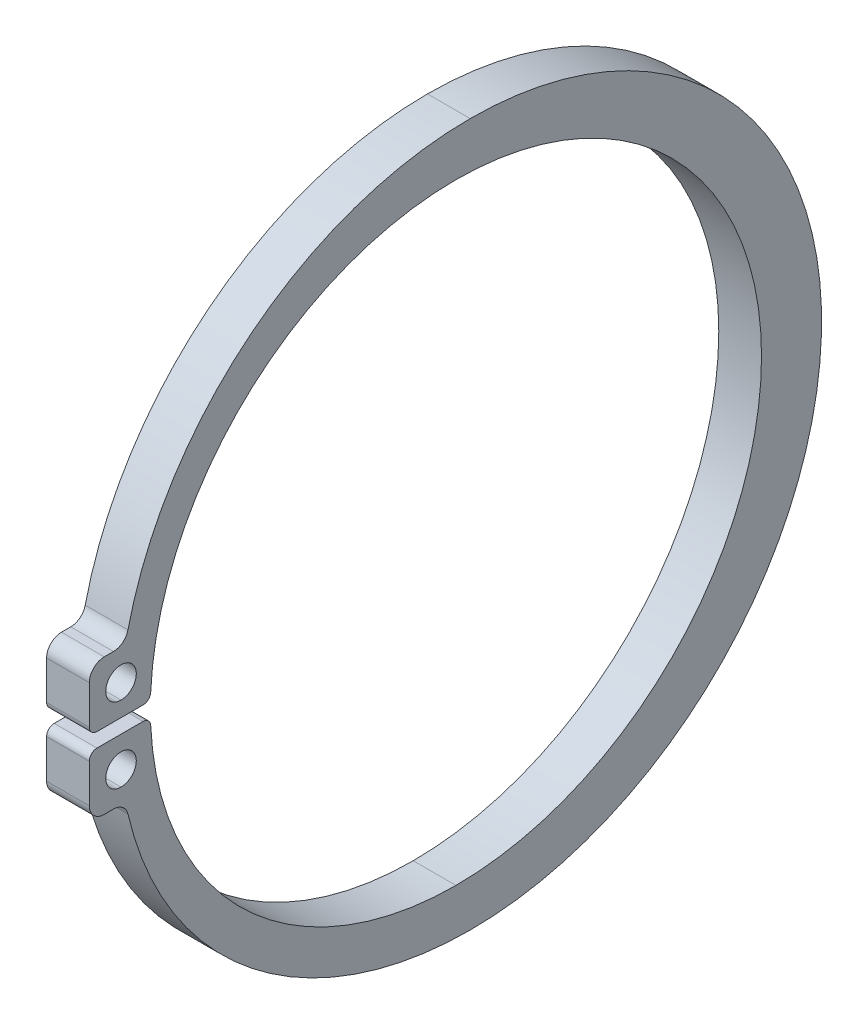
ISO-10303-21;
HEADER;
FILE_DESCRIPTION(('STEP AP214'),'2;1');
FILE_NAME('part.step','',(''),(''),'','','');
FILE_SCHEMA(('AUTOMOTIVE_DESIGN { 1 0 10303 214 1 1 1 1 }'));
ENDSEC;
DATA;
#1=APPLICATION_CONTEXT('core data for automotive mechanical design processes');
#2=APPLICATION_PROTOCOL_DEFINITION('international standard','automotive_design',2000,#1);
#3=PRODUCT_CONTEXT('',#1,'mechanical');
#4=PRODUCT('Part','Part','',(#3));
#5=PRODUCT_RELATED_PRODUCT_CATEGORY('part','',(#4));
#6=PRODUCT_DEFINITION_FORMATION('','',#4);
#7=PRODUCT_DEFINITION_CONTEXT('part definition',#1,'design');
#8=PRODUCT_DEFINITION('design','',#6,#7);
#9=PRODUCT_DEFINITION_SHAPE('','',#8);
#10=(LENGTH_UNIT() NAMED_UNIT(*) SI_UNIT(.MILLI.,.METRE.));
#11=(NAMED_UNIT(*) PLANE_ANGLE_UNIT() SI_UNIT($,.RADIAN.));
#12=(NAMED_UNIT(*) SI_UNIT($,.STERADIAN.) SOLID_ANGLE_UNIT());
#13=UNCERTAINTY_MEASURE_WITH_UNIT(LENGTH_MEASURE(1.E-05),#10,'distance_accuracy_value','');
#14=(GEOMETRIC_REPRESENTATION_CONTEXT(3) GLOBAL_UNCERTAINTY_ASSIGNED_CONTEXT((#13)) GLOBAL_UNIT_ASSIGNED_CONTEXT((#10,
#11,#12)) REPRESENTATION_CONTEXT('',''));
#15=CARTESIAN_POINT('',(0.,0.,0.));
#16=DIRECTION('',(0.,0.,1.));
#17=DIRECTION('',(1.,0.,0.));
#18=AXIS2_PLACEMENT_3D('',#15,#16,#17);
#19=CARTESIAN_POINT('',(-34.,7.87708333333333,-1.25745180226376));
#20=DIRECTION('',(1.,0.,0.));
#21=DIRECTION('',(0.,-1.,0.));
#22=AXIS2_PLACEMENT_3D('',#19,#20,#21);
#23=CYLINDRICAL_SURFACE('',#22,0.17875);
#24=CARTESIAN_POINT('',(-34.,7.87708333333333,-1.25745180226376));
#25=DIRECTION('',(-1.,0.,0.));
#26=DIRECTION('',(0.,-1.,0.));
#27=AXIS2_PLACEMENT_3D('',#24,#25,#26);
#28=CIRCLE('',#27,0.17875);
#29=CARTESIAN_POINT('',(-34.,8.05583333333333,-1.25745180226376));
#30=VERTEX_POINT('',#29);
#31=CARTESIAN_POINT('',(-34.,7.8855081300813,-1.4360031542602));
#32=VERTEX_POINT('',#31);
#33=EDGE_CURVE('E185',#30,#32,#28,.T.);
#34=ORIENTED_EDGE('',*,*,#33,.F.);
#35=DIRECTION('',(-1.,0.,0.));
#36=VECTOR('',#35,1.);
#37=CARTESIAN_POINT('',(-34.,8.05583333333333,-1.25745180226376));
#38=LINE('',#37,#36);
#39=CARTESIAN_POINT('',(-33.,8.05583333333333,-1.25745180226376));
#40=VERTEX_POINT('',#39);
#41=EDGE_CURVE('E301',#40,#30,#38,.T.);
#42=ORIENTED_EDGE('',*,*,#41,.F.);
#43=CARTESIAN_POINT('',(-33.,7.87708333333333,-1.25745180226376));
#44=DIRECTION('',(1.,0.,0.));
#45=DIRECTION('',(0.,-1.,0.));
#46=AXIS2_PLACEMENT_3D('',#43,#44,#45);
#47=CIRCLE('',#46,0.17875);
#48=CARTESIAN_POINT('',(-33.,7.8855081300813,-1.4360031542602));
#49=VERTEX_POINT('',#48);
#50=EDGE_CURVE('E905',#49,#40,#47,.T.);
#51=ORIENTED_EDGE('',*,*,#50,.F.);
#52=DIRECTION('',(1.,0.,0.));
#53=VECTOR('',#52,1.);
#54=CARTESIAN_POINT('',(-34.,7.8855081300813,-1.4360031542602));
#55=LINE('',#54,#53);
#56=EDGE_CURVE('E38',#32,#49,#55,.T.);
#57=ORIENTED_EDGE('',*,*,#56,.F.);
#58=EDGE_LOOP('',(#34,#42,#51,#57));
#59=FACE_BOUND('',#58,.T.);
#60=ADVANCED_FACE('F16',(#59),#23,.T.);
#61=CARTESIAN_POINT('',(-34.,8.56791666666667,-1.25745180226376));
#62=DIRECTION('',(1.,0.,0.));
#63=DIRECTION('',(0.,-1.,0.));
#64=AXIS2_PLACEMENT_3D('',#61,#62,#63);
#65=CYLINDRICAL_SURFACE('',#64,0.17875);
#66=CARTESIAN_POINT('',(-34.,8.56791666666667,-1.25745180226376));
#67=DIRECTION('',(-1.,0.,0.));
#68=DIRECTION('',(0.,-1.,0.));
#69=AXIS2_PLACEMENT_3D('',#66,#67,#68);
#70=CIRCLE('',#69,0.17875);
#71=CARTESIAN_POINT('',(-34.,8.5594918699187,-1.4360031542602));
#72=VERTEX_POINT('',#71);
#73=CARTESIAN_POINT('',(-34.,8.38916666666667,-1.25745180226376));
#74=VERTEX_POINT('',#73);
#75=EDGE_CURVE('E192',#72,#74,#70,.T.);
#76=ORIENTED_EDGE('',*,*,#75,.F.);
#77=DIRECTION('',(-1.,0.,0.));
#78=VECTOR('',#77,1.);
#79=CARTESIAN_POINT('',(-34.,8.5594918699187,-1.4360031542602));
#80=LINE('',#79,#78);
#81=CARTESIAN_POINT('',(-33.,8.5594918699187,-1.4360031542602));
#82=VERTEX_POINT('',#81);
#83=EDGE_CURVE('E940',#82,#72,#80,.T.);
#84=ORIENTED_EDGE('',*,*,#83,.F.);
#85=CARTESIAN_POINT('',(-33.,8.56791666666667,-1.25745180226376));
#86=DIRECTION('',(1.,0.,0.));
#87=DIRECTION('',(0.,-1.,0.));
#88=AXIS2_PLACEMENT_3D('',#85,#86,#87);
#89=CIRCLE('',#88,0.17875);
#90=CARTESIAN_POINT('',(-33.,8.38916666666667,-1.25745180226376));
#91=VERTEX_POINT('',#90);
#92=EDGE_CURVE('E899',#91,#82,#89,.T.);
#93=ORIENTED_EDGE('',*,*,#92,.F.);
#94=DIRECTION('',(1.,0.,0.));
#95=VECTOR('',#94,1.);
#96=CARTESIAN_POINT('',(-34.,8.38916666666667,-1.25745180226376));
#97=LINE('',#96,#95);
#98=EDGE_CURVE('E207',#74,#91,#97,.T.);
#99=ORIENTED_EDGE('',*,*,#98,.F.);
#100=EDGE_LOOP('',(#76,#84,#93,#99));
#101=FACE_BOUND('',#100,.T.);
#102=ADVANCED_FACE('F558',(#101),#65,.T.);
#103=CARTESIAN_POINT('',(-34.,7.87708333333333,-0.178749999999979));
#104=DIRECTION('',(1.,0.,0.));
#105=DIRECTION('',(0.,-1.,0.));
#106=AXIS2_PLACEMENT_3D('',#103,#104,#105);
#107=CYLINDRICAL_SURFACE('',#106,0.17875);
#108=CARTESIAN_POINT('',(-34.,7.87708333333333,-0.178749999999979));
#109=DIRECTION('',(-1.,0.,0.));
#110=DIRECTION('',(0.,-1.,0.));
#111=AXIS2_PLACEMENT_3D('',#108,#109,#110);
#112=CIRCLE('',#111,0.17875);
#113=CARTESIAN_POINT('',(-34.,7.87708333333333,0.));
#114=VERTEX_POINT('',#113);
#115=CARTESIAN_POINT('',(-34.,8.05583333333333,-0.178749999999979));
#116=VERTEX_POINT('',#115);
#117=EDGE_CURVE('E159',#114,#116,#112,.T.);
#118=ORIENTED_EDGE('',*,*,#117,.F.);
#119=DIRECTION('',(-1.,0.,0.));
#120=VECTOR('',#119,1.);
#121=CARTESIAN_POINT('',(-34.,7.87708333333333,0.));
#122=LINE('',#121,#120);
#123=CARTESIAN_POINT('',(-33.,7.87708333333333,0.));
#124=VERTEX_POINT('',#123);
#125=EDGE_CURVE('E25',#124,#114,#122,.T.);
#126=ORIENTED_EDGE('',*,*,#125,.F.);
#127=CARTESIAN_POINT('',(-33.,7.87708333333333,-0.178749999999978));
#128=DIRECTION('',(1.,0.,0.));
#129=DIRECTION('',(0.,-1.,0.));
#130=AXIS2_PLACEMENT_3D('',#127,#128,#129);
#131=CIRCLE('',#130,0.17875);
#132=CARTESIAN_POINT('',(-33.,8.05583333333333,-0.178749999999978));
#133=VERTEX_POINT('',#132);
#134=EDGE_CURVE('E917',#133,#124,#131,.T.);
#135=ORIENTED_EDGE('',*,*,#134,.F.);
#136=DIRECTION('',(1.,0.,0.));
#137=VECTOR('',#136,1.);
#138=CARTESIAN_POINT('',(-34.,8.05583333333333,-0.178749999999979));
#139=LINE('',#138,#137);
#140=EDGE_CURVE('E161',#116,#133,#139,.T.);
#141=ORIENTED_EDGE('',*,*,#140,.F.);
#142=EDGE_LOOP('',(#118,#126,#135,#141));
#143=FACE_BOUND('',#142,.T.);
#144=ADVANCED_FACE('F160',(#143),#107,.T.);
#145=CARTESIAN_POINT('',(-34.,8.56791666666667,-0.178749999999979));
#146=DIRECTION('',(1.,0.,0.));
#147=DIRECTION('',(0.,-1.,0.));
#148=AXIS2_PLACEMENT_3D('',#145,#146,#147);
#149=CYLINDRICAL_SURFACE('',#148,0.17875);
#150=CARTESIAN_POINT('',(-34.,8.56791666666667,-0.178749999999979));
#151=DIRECTION('',(-1.,0.,0.));
#152=DIRECTION('',(0.,-1.,0.));
#153=AXIS2_PLACEMENT_3D('',#150,#151,#152);
#154=CIRCLE('',#153,0.17875);
#155=CARTESIAN_POINT('',(-34.,8.38916666666667,-0.178749999999979));
#156=VERTEX_POINT('',#155);
#157=CARTESIAN_POINT('',(-34.,8.56791666666667,0.));
#158=VERTEX_POINT('',#157);
#159=EDGE_CURVE('E280',#156,#158,#154,.T.);
#160=ORIENTED_EDGE('',*,*,#159,.F.);
#161=DIRECTION('',(-1.,0.,0.));
#162=VECTOR('',#161,1.);
#163=CARTESIAN_POINT('',(-34.,8.38916666666667,-0.178749999999979));
#164=LINE('',#163,#162);
#165=CARTESIAN_POINT('',(-33.,8.38916666666667,-0.178749999999978));
#166=VERTEX_POINT('',#165);
#167=EDGE_CURVE('E204',#166,#156,#164,.T.);
#168=ORIENTED_EDGE('',*,*,#167,.F.);
#169=CARTESIAN_POINT('',(-33.,8.56791666666667,-0.178749999999978));
#170=DIRECTION('',(1.,0.,0.));
#171=DIRECTION('',(0.,-1.,0.));
#172=AXIS2_PLACEMENT_3D('',#169,#170,#171);
#173=CIRCLE('',#172,0.17875);
#174=CARTESIAN_POINT('',(-33.,8.56791666666667,0.));
#175=VERTEX_POINT('',#174);
#176=EDGE_CURVE('E889',#175,#166,#173,.T.);
#177=ORIENTED_EDGE('',*,*,#176,.F.);
#178=DIRECTION('',(1.,0.,0.));
#179=VECTOR('',#178,1.);
#180=CARTESIAN_POINT('',(-34.,8.56791666666667,0.));
#181=LINE('',#180,#179);
#182=EDGE_CURVE('E213',#158,#175,#181,.T.);
#183=ORIENTED_EDGE('',*,*,#182,.F.);
#184=EDGE_LOOP('',(#160,#168,#177,#183));
#185=FACE_BOUND('',#184,.T.);
#186=ADVANCED_FACE('F542',(#185),#149,.T.);
#187=CARTESIAN_POINT('',(-33.,6.27705284552846,-0.563811003901857));
#188=DIRECTION('',(-1.,0.,0.));
#189=DIRECTION('',(0.,1.,0.));
#190=AXIS2_PLACEMENT_3D('',#187,#188,#189);
#191=CYLINDRICAL_SURFACE('',#190,0.348780487804878);
#192=CARTESIAN_POINT('',(-33.,6.27705284552846,-0.563811003901857));
#193=DIRECTION('',(-1.,0.,0.));
#194=DIRECTION('',(0.,-1.,0.));
#195=AXIS2_PLACEMENT_3D('',#192,#193,#194);
#196=CIRCLE('',#195,0.348780487804878);
#197=CARTESIAN_POINT('',(-33.,6.62583333333333,-0.563811003901857));
#198=VERTEX_POINT('',#197);
#199=CARTESIAN_POINT('',(-33.,6.35621651407257,-0.903488707403349));
#200=VERTEX_POINT('',#199);
#201=EDGE_CURVE('E236',#198,#200,#196,.T.);
#202=ORIENTED_EDGE('',*,*,#201,.F.);
#203=DIRECTION('',(1.,0.,0.));
#204=VECTOR('',#203,1.);
#205=CARTESIAN_POINT('',(-34.,6.62583333333333,-0.563811003901859));
#206=LINE('',#205,#204);
#207=CARTESIAN_POINT('',(-34.,6.62583333333333,-0.563811003901859));
#208=VERTEX_POINT('',#207);
#209=EDGE_CURVE('E157',#208,#198,#206,.T.);
#210=ORIENTED_EDGE('',*,*,#209,.F.);
#211=CARTESIAN_POINT('',(-34.,6.27705284552846,-0.563811003901859));
#212=DIRECTION('',(1.,0.,0.));
#213=DIRECTION('',(0.,-1.,0.));
#214=AXIS2_PLACEMENT_3D('',#211,#212,#213);
#215=CIRCLE('',#214,0.348780487804878);
#216=CARTESIAN_POINT('',(-34.,6.35621651407257,-0.90348870740335));
#217=VERTEX_POINT('',#216);
#218=EDGE_CURVE('E299',#217,#208,#215,.T.);
#219=ORIENTED_EDGE('',*,*,#218,.F.);
#220=DIRECTION('',(-1.,0.,0.));
#221=VECTOR('',#220,1.);
#222=CARTESIAN_POINT('',(-33.,6.35621651407257,-0.903488707403349));
#223=LINE('',#222,#221);
#224=EDGE_CURVE('E239',#200,#217,#223,.T.);
#225=ORIENTED_EDGE('',*,*,#224,.F.);
#226=EDGE_LOOP('',(#202,#210,#219,#225));
#227=FACE_BOUND('',#226,.T.);
#228=ADVANCED_FACE('F237',(#227),#191,.F.);
#229=CARTESIAN_POINT('',(-34.,6.97461382113821,-0.348780487804859));
#230=DIRECTION('',(1.,0.,0.));
#231=DIRECTION('',(0.,-1.,0.));
#232=AXIS2_PLACEMENT_3D('',#229,#230,#231);
#233=CYLINDRICAL_SURFACE('',#232,0.348780487804878);
#234=CARTESIAN_POINT('',(-34.,6.97461382113821,-0.348780487804859));
#235=DIRECTION('',(-1.,0.,0.));
#236=DIRECTION('',(0.,-1.,0.));
#237=AXIS2_PLACEMENT_3D('',#234,#235,#236);
#238=CIRCLE('',#237,0.348780487804878);
#239=CARTESIAN_POINT('',(-34.,6.62583333333333,-0.348780487804859));
#240=VERTEX_POINT('',#239);
#241=CARTESIAN_POINT('',(-34.,6.97461382113821,0.));
#242=VERTEX_POINT('',#241);
#243=EDGE_CURVE('E172',#240,#242,#238,.T.);
#244=ORIENTED_EDGE('',*,*,#243,.F.);
#245=DIRECTION('',(-1.,0.,0.));
#246=VECTOR('',#245,1.);
#247=CARTESIAN_POINT('',(-34.,6.62583333333333,-0.348780487804859));
#248=LINE('',#247,#246);
#249=CARTESIAN_POINT('',(-33.,6.62583333333333,-0.348780487804857));
#250=VERTEX_POINT('',#249);
#251=EDGE_CURVE('E218',#250,#240,#248,.T.);
#252=ORIENTED_EDGE('',*,*,#251,.F.);
#253=CARTESIAN_POINT('',(-33.,6.97461382113821,-0.348780487804857));
#254=DIRECTION('',(1.,0.,0.));
#255=DIRECTION('',(0.,-1.,0.));
#256=AXIS2_PLACEMENT_3D('',#253,#254,#255);
#257=CIRCLE('',#256,0.348780487804878);
#258=CARTESIAN_POINT('',(-33.,6.97461382113821,0.));
#259=VERTEX_POINT('',#258);
#260=EDGE_CURVE('E249',#259,#250,#257,.T.);
#261=ORIENTED_EDGE('',*,*,#260,.F.);
#262=DIRECTION('',(1.,0.,0.));
#263=VECTOR('',#262,1.);
#264=CARTESIAN_POINT('',(-34.,6.97461382113821,0.));
#265=LINE('',#264,#263);
#266=EDGE_CURVE('E10',#242,#259,#265,.T.);
#267=ORIENTED_EDGE('',*,*,#266,.F.);
#268=EDGE_LOOP('',(#244,#252,#261,#267));
#269=FACE_BOUND('',#268,.T.);
#270=ADVANCED_FACE('F525',(#269),#233,.T.);
#271=CARTESIAN_POINT('',(-34.,9.47038617886179,-0.348780487804859));
#272=DIRECTION('',(1.,0.,0.));
#273=DIRECTION('',(0.,-1.,0.));
#274=AXIS2_PLACEMENT_3D('',#271,#272,#273);
#275=CYLINDRICAL_SURFACE('',#274,0.348780487804878);
#276=CARTESIAN_POINT('',(-34.,9.47038617886179,-0.348780487804859));
#277=DIRECTION('',(-1.,0.,0.));
#278=DIRECTION('',(0.,-1.,0.));
#279=AXIS2_PLACEMENT_3D('',#276,#277,#278);
#280=CIRCLE('',#279,0.348780487804878);
#281=CARTESIAN_POINT('',(-34.,9.47038617886179,0.));
#282=VERTEX_POINT('',#281);
#283=CARTESIAN_POINT('',(-34.,9.81916666666667,-0.348780487804859));
#284=VERTEX_POINT('',#283);
#285=EDGE_CURVE('E288',#282,#284,#280,.T.);
#286=ORIENTED_EDGE('',*,*,#285,.F.);
#287=DIRECTION('',(-1.,0.,0.));
#288=VECTOR('',#287,1.);
#289=CARTESIAN_POINT('',(-34.,9.47038617886179,0.));
#290=LINE('',#289,#288);
#291=CARTESIAN_POINT('',(-33.,9.47038617886179,0.));
#292=VERTEX_POINT('',#291);
#293=EDGE_CURVE('E215',#292,#282,#290,.T.);
#294=ORIENTED_EDGE('',*,*,#293,.F.);
#295=CARTESIAN_POINT('',(-33.,9.47038617886179,-0.348780487804857));
#296=DIRECTION('',(1.,0.,0.));
#297=DIRECTION('',(0.,-1.,0.));
#298=AXIS2_PLACEMENT_3D('',#295,#296,#297);
#299=CIRCLE('',#298,0.348780487804878);
#300=CARTESIAN_POINT('',(-33.,9.81916666666667,-0.348780487804857));
#301=VERTEX_POINT('',#300);
#302=EDGE_CURVE('E267',#301,#292,#299,.T.);
#303=ORIENTED_EDGE('',*,*,#302,.F.);
#304=DIRECTION('',(1.,0.,0.));
#305=VECTOR('',#304,1.);
#306=CARTESIAN_POINT('',(-34.,9.81916666666667,-0.348780487804859));
#307=LINE('',#306,#305);
#308=EDGE_CURVE('E210',#284,#301,#307,.T.);
#309=ORIENTED_EDGE('',*,*,#308,.F.);
#310=EDGE_LOOP('',(#286,#294,#303,#309));
#311=FACE_BOUND('',#310,.T.);
#312=ADVANCED_FACE('F361',(#311),#275,.T.);
#313=CARTESIAN_POINT('',(-33.,10.1679471544715,-0.563811003901857));
#314=DIRECTION('',(-1.,0.,0.));
#315=DIRECTION('',(0.,1.,0.));
#316=AXIS2_PLACEMENT_3D('',#313,#314,#315);
#317=CYLINDRICAL_SURFACE('',#316,0.348780487804878);
#318=CARTESIAN_POINT('',(-33.,10.1679471544715,-0.563811003901857));
#319=DIRECTION('',(-1.,0.,0.));
#320=DIRECTION('',(0.,-1.,0.));
#321=AXIS2_PLACEMENT_3D('',#318,#319,#320);
#322=CIRCLE('',#321,0.348780487804878);
#323=CARTESIAN_POINT('',(-33.,10.0887834859274,-0.903488707403349));
#324=VERTEX_POINT('',#323);
#325=CARTESIAN_POINT('',(-33.,9.81916666666667,-0.563811003901857));
#326=VERTEX_POINT('',#325);
#327=EDGE_CURVE('E244',#324,#326,#322,.T.);
#328=ORIENTED_EDGE('',*,*,#327,.F.);
#329=DIRECTION('',(1.,0.,0.));
#330=VECTOR('',#329,1.);
#331=CARTESIAN_POINT('',(-33.,10.0887834859274,-0.903488707403349));
#332=LINE('',#331,#330);
#333=CARTESIAN_POINT('',(-34.,10.0887834859274,-0.90348870740335));
#334=VERTEX_POINT('',#333);
#335=EDGE_CURVE('E848',#334,#324,#332,.T.);
#336=ORIENTED_EDGE('',*,*,#335,.F.);
#337=CARTESIAN_POINT('',(-34.,10.1679471544715,-0.563811003901859));
#338=DIRECTION('',(1.,0.,0.));
#339=DIRECTION('',(0.,-1.,0.));
#340=AXIS2_PLACEMENT_3D('',#337,#338,#339);
#341=CIRCLE('',#340,0.348780487804878);
#342=CARTESIAN_POINT('',(-34.,9.81916666666667,-0.563811003901859));
#343=VERTEX_POINT('',#342);
#344=EDGE_CURVE('E296',#343,#334,#341,.T.);
#345=ORIENTED_EDGE('',*,*,#344,.F.);
#346=DIRECTION('',(-1.,0.,0.));
#347=VECTOR('',#346,1.);
#348=CARTESIAN_POINT('',(-34.,9.81916666666667,-0.563811003901859));
#349=LINE('',#348,#347);
#350=EDGE_CURVE('E214',#326,#343,#349,.T.);
#351=ORIENTED_EDGE('',*,*,#350,.F.);
#352=EDGE_LOOP('',(#328,#336,#345,#351));
#353=FACE_BOUND('',#352,.T.);
#354=ADVANCED_FACE('F356',(#353),#317,.F.);
#355=CARTESIAN_POINT('',(-34.,7.34083333333333,-0.741312313262498));
#356=DIRECTION('',(1.,0.,0.));
#357=DIRECTION('',(0.,-1.,0.));
#358=AXIS2_PLACEMENT_3D('',#355,#356,#357);
#359=CYLINDRICAL_SURFACE('',#358,0.3575);
#360=DIRECTION('',(1.,0.,0.));
#361=VECTOR('',#360,1.);
#362=CARTESIAN_POINT('',(-34.,7.69833333333333,-0.741312313262498));
#363=LINE('',#362,#361);
#364=CARTESIAN_POINT('',(-34.,7.69833333333333,-0.741312313262498));
#365=VERTEX_POINT('',#364);
#366=CARTESIAN_POINT('',(-33.,7.69833333333333,-0.741312313262497));
#367=VERTEX_POINT('',#366);
#368=EDGE_CURVE('E972',#365,#367,#363,.T.);
#369=ORIENTED_EDGE('',*,*,#368,.F.);
#370=CARTESIAN_POINT('',(-34.,7.34083333333333,-0.741312313262498));
#371=DIRECTION('',(-1.,0.,0.));
#372=DIRECTION('',(0.,1.,0.));
#373=AXIS2_PLACEMENT_3D('',#370,#371,#372);
#374=CIRCLE('',#373,0.3575);
#375=CARTESIAN_POINT('',(-34.,6.98333333333333,-0.741312313262498));
#376=VERTEX_POINT('',#375);
#377=EDGE_CURVE('E196',#365,#376,#374,.T.);
#378=ORIENTED_EDGE('',*,*,#377,.T.);
#379=DIRECTION('',(1.,0.,0.));
#380=VECTOR('',#379,1.);
#381=CARTESIAN_POINT('',(-34.,6.98333333333333,-0.741312313262498));
#382=LINE('',#381,#380);
#383=CARTESIAN_POINT('',(-33.,6.98333333333333,-0.741312313262497));
#384=VERTEX_POINT('',#383);
#385=EDGE_CURVE('E973',#376,#384,#382,.T.);
#386=ORIENTED_EDGE('',*,*,#385,.T.);
#387=CARTESIAN_POINT('',(-33.,7.34083333333333,-0.741312313262497));
#388=DIRECTION('',(-1.,0.,0.));
#389=DIRECTION('',(0.,1.,0.));
#390=AXIS2_PLACEMENT_3D('',#387,#388,#389);
#391=CIRCLE('',#390,0.3575);
#392=EDGE_CURVE('E271',#367,#384,#391,.T.);
#393=ORIENTED_EDGE('',*,*,#392,.F.);
#394=EDGE_LOOP('',(#369,#378,#386,#393));
#395=FACE_BOUND('',#394,.T.);
#396=ADVANCED_FACE('F360',(#395),#359,.F.);
#397=CARTESIAN_POINT('',(-34.,9.10416666666667,-0.741312313262498));
#398=DIRECTION('',(1.,0.,0.));
#399=DIRECTION('',(0.,-1.,0.));
#400=AXIS2_PLACEMENT_3D('',#397,#398,#399);
#401=CYLINDRICAL_SURFACE('',#400,0.3575);
#402=DIRECTION('',(1.,0.,0.));
#403=VECTOR('',#402,1.);
#404=CARTESIAN_POINT('',(-34.,9.46166666666667,-0.741312313262498));
#405=LINE('',#404,#403);
#406=CARTESIAN_POINT('',(-34.,9.46166666666667,-0.741312313262498));
#407=VERTEX_POINT('',#406);
#408=CARTESIAN_POINT('',(-33.,9.46166666666667,-0.741312313262497));
#409=VERTEX_POINT('',#408);
#410=EDGE_CURVE('E984',#407,#409,#405,.T.);
#411=ORIENTED_EDGE('',*,*,#410,.F.);
#412=CARTESIAN_POINT('',(-34.,9.10416666666667,-0.741312313262498));
#413=DIRECTION('',(1.,0.,0.));
#414=DIRECTION('',(0.,-1.,0.));
#415=AXIS2_PLACEMENT_3D('',#412,#413,#414);
#416=CIRCLE('',#415,0.3575);
#417=CARTESIAN_POINT('',(-34.,8.74666666666667,-0.741312313262498));
#418=VERTEX_POINT('',#417);
#419=EDGE_CURVE('E200',#418,#407,#416,.T.);
#420=ORIENTED_EDGE('',*,*,#419,.F.);
#421=DIRECTION('',(1.,0.,0.));
#422=VECTOR('',#421,1.);
#423=CARTESIAN_POINT('',(-34.,8.74666666666667,-0.741312313262498));
#424=LINE('',#423,#422);
#425=CARTESIAN_POINT('',(-33.,8.74666666666667,-0.741312313262497));
#426=VERTEX_POINT('',#425);
#427=EDGE_CURVE('E968',#418,#426,#424,.T.);
#428=ORIENTED_EDGE('',*,*,#427,.T.);
#429=CARTESIAN_POINT('',(-33.,9.10416666666667,-0.741312313262497));
#430=DIRECTION('',(1.,0.,0.));
#431=DIRECTION('',(0.,-1.,0.));
#432=AXIS2_PLACEMENT_3D('',#429,#430,#431);
#433=CIRCLE('',#432,0.3575);
#434=EDGE_CURVE('E272',#426,#409,#433,.T.);
#435=ORIENTED_EDGE('',*,*,#434,.T.);
#436=EDGE_LOOP('',(#411,#420,#428,#435));
#437=FACE_BOUND('',#436,.T.);
#438=ADVANCED_FACE('F501',(#437),#401,.F.);
#439=CARTESIAN_POINT('',(-34.,8.05583333333333,0.));
#440=DIRECTION('',(0.,0.,1.));
#441=DIRECTION('',(-1.,0.,0.));
#442=AXIS2_PLACEMENT_3D('',#439,#440,#441);
#443=PLANE('',#442);
#444=DIRECTION('',(0.,-1.,0.));
#445=VECTOR('',#444,1.);
#446=CARTESIAN_POINT('',(-33.,8.05583333333333,0.));
#447=LINE('',#446,#445);
#448=EDGE_CURVE('E152',#124,#259,#447,.T.);
#449=ORIENTED_EDGE('',*,*,#448,.F.);
#450=ORIENTED_EDGE('',*,*,#125,.T.);
#451=DIRECTION('',(0.,-1.,0.));
#452=VECTOR('',#451,1.);
#453=CARTESIAN_POINT('',(-34.,8.05583333333333,0.));
#454=LINE('',#453,#452);
#455=EDGE_CURVE('E149',#114,#242,#454,.T.);
#456=ORIENTED_EDGE('',*,*,#455,.T.);
#457=ORIENTED_EDGE('',*,*,#266,.T.);
#458=EDGE_LOOP('',(#449,#450,#456,#457));
#459=FACE_BOUND('',#458,.T.);
#460=ADVANCED_FACE('F147',(#459),#443,.T.);
#461=CARTESIAN_POINT('',(-34.,6.62583333333333,0.));
#462=DIRECTION('',(0.,-1.,0.));
#463=DIRECTION('',(0.,0.,1.));
#464=AXIS2_PLACEMENT_3D('',#461,#462,#463);
#465=PLANE('',#464);
#466=DIRECTION('',(0.,0.,-1.));
#467=VECTOR('',#466,1.);
#468=CARTESIAN_POINT('',(-33.,6.62583333333333,0.));
#469=LINE('',#468,#467);
#470=EDGE_CURVE('E230',#250,#198,#469,.T.);
#471=ORIENTED_EDGE('',*,*,#470,.F.);
#472=ORIENTED_EDGE('',*,*,#251,.T.);
#473=DIRECTION('',(0.,0.,-1.));
#474=VECTOR('',#473,1.);
#475=CARTESIAN_POINT('',(-34.,6.62583333333333,0.));
#476=LINE('',#475,#474);
#477=EDGE_CURVE('E180',#240,#208,#476,.T.);
#478=ORIENTED_EDGE('',*,*,#477,.T.);
#479=ORIENTED_EDGE('',*,*,#209,.T.);
#480=EDGE_LOOP('',(#471,#472,#478,#479));
#481=FACE_BOUND('',#480,.T.);
#482=ADVANCED_FACE('F228',(#481),#465,.T.);
#483=CARTESIAN_POINT('',(-34.,8.38916666666667,0.));
#484=DIRECTION('',(0.,0.,-1.));
#485=DIRECTION('',(0.,-1.,0.));
#486=AXIS2_PLACEMENT_3D('',#483,#484,#485);
#487=PLANE('',#486);
#488=DIRECTION('',(0.,1.,0.));
#489=VECTOR('',#488,1.);
#490=CARTESIAN_POINT('',(-34.,8.38916666666667,0.));
#491=LINE('',#490,#489);
#492=EDGE_CURVE('E284',#158,#282,#491,.T.);
#493=ORIENTED_EDGE('',*,*,#492,.F.);
#494=ORIENTED_EDGE('',*,*,#182,.T.);
#495=DIRECTION('',(0.,1.,0.));
#496=VECTOR('',#495,1.);
#497=CARTESIAN_POINT('',(-33.,8.38916666666667,0.));
#498=LINE('',#497,#496);
#499=EDGE_CURVE('E885',#175,#292,#498,.T.);
#500=ORIENTED_EDGE('',*,*,#499,.T.);
#501=ORIENTED_EDGE('',*,*,#293,.T.);
#502=EDGE_LOOP('',(#493,#494,#500,#501));
#503=FACE_BOUND('',#502,.T.);
#504=ADVANCED_FACE('F418',(#503),#487,.F.);
#505=CARTESIAN_POINT('',(-34.,9.81916666666667,0.));
#506=DIRECTION('',(0.,-1.,0.));
#507=DIRECTION('',(0.,0.,-1.));
#508=AXIS2_PLACEMENT_3D('',#505,#506,#507);
#509=PLANE('',#508);
#510=DIRECTION('',(0.,0.,-1.));
#511=VECTOR('',#510,1.);
#512=CARTESIAN_POINT('',(-33.,9.81916666666667,0.));
#513=LINE('',#512,#511);
#514=EDGE_CURVE('E262',#301,#326,#513,.T.);
#515=ORIENTED_EDGE('',*,*,#514,.T.);
#516=ORIENTED_EDGE('',*,*,#350,.T.);
#517=DIRECTION('',(0.,0.,-1.));
#518=VECTOR('',#517,1.);
#519=CARTESIAN_POINT('',(-34.,9.81916666666667,0.));
#520=LINE('',#519,#518);
#521=EDGE_CURVE('E292',#284,#343,#520,.T.);
#522=ORIENTED_EDGE('',*,*,#521,.F.);
#523=ORIENTED_EDGE('',*,*,#308,.T.);
#524=EDGE_LOOP('',(#515,#516,#522,#523));
#525=FACE_BOUND('',#524,.T.);
#526=ADVANCED_FACE('F382',(#525),#509,.F.);
#527=CARTESIAN_POINT('',(-34.,8.05583333333333,-1.42999999999998));
#528=DIRECTION('',(0.,1.,0.));
#529=DIRECTION('',(0.,0.,-1.));
#530=AXIS2_PLACEMENT_3D('',#527,#528,#529);
#531=PLANE('',#530);
#532=DIRECTION('',(0.,0.,1.));
#533=VECTOR('',#532,1.);
#534=CARTESIAN_POINT('',(-34.,8.05583333333333,-1.42999999999998));
#535=LINE('',#534,#533);
#536=EDGE_CURVE('E166',#30,#116,#535,.T.);
#537=ORIENTED_EDGE('',*,*,#536,.T.);
#538=ORIENTED_EDGE('',*,*,#140,.T.);
#539=DIRECTION('',(0.,0.,1.));
#540=VECTOR('',#539,1.);
#541=CARTESIAN_POINT('',(-33.,8.05583333333333,-1.42999999999998));
#542=LINE('',#541,#540);
#543=EDGE_CURVE('E911',#40,#133,#542,.T.);
#544=ORIENTED_EDGE('',*,*,#543,.F.);
#545=ORIENTED_EDGE('',*,*,#41,.T.);
#546=EDGE_LOOP('',(#537,#538,#544,#545));
#547=FACE_BOUND('',#546,.T.);
#548=ADVANCED_FACE('F377',(#547),#531,.T.);
#549=CARTESIAN_POINT('',(-34.,8.38916666666667,-1.42999999999998));
#550=DIRECTION('',(0.,1.,0.));
#551=DIRECTION('',(0.,0.,-1.));
#552=AXIS2_PLACEMENT_3D('',#549,#550,#551);
#553=PLANE('',#552);
#554=DIRECTION('',(0.,0.,1.));
#555=VECTOR('',#554,1.);
#556=CARTESIAN_POINT('',(-33.,8.38916666666667,-1.42999999999998));
#557=LINE('',#556,#555);
#558=EDGE_CURVE('E893',#91,#166,#557,.T.);
#559=ORIENTED_EDGE('',*,*,#558,.T.);
#560=ORIENTED_EDGE('',*,*,#167,.T.);
#561=DIRECTION('',(0.,0.,1.));
#562=VECTOR('',#561,1.);
#563=CARTESIAN_POINT('',(-34.,8.38916666666667,-1.42999999999998));
#564=LINE('',#563,#562);
#565=EDGE_CURVE('E276',#74,#156,#564,.T.);
#566=ORIENTED_EDGE('',*,*,#565,.F.);
#567=ORIENTED_EDGE('',*,*,#98,.T.);
#568=EDGE_LOOP('',(#559,#560,#566,#567));
#569=FACE_BOUND('',#568,.T.);
#570=ADVANCED_FACE('F381',(#569),#553,.F.);
#571=CARTESIAN_POINT('',(-34.,8.2225,-8.57805723411767));
#572=DIRECTION('',(1.,0.,0.));
#573=DIRECTION('',(0.,-1.,0.));
#574=AXIS2_PLACEMENT_3D('',#571,#572,#573);
#575=CYLINDRICAL_SURFACE('',#574,7.15);
#576=DIRECTION('',(1.,0.,0.));
#577=VECTOR('',#576,1.);
#578=CARTESIAN_POINT('',(-34.,1.0725,-8.57805723411767));
#579=LINE('',#578,#577);
#580=CARTESIAN_POINT('',(-34.,1.0725,-8.57805723411767));
#581=VERTEX_POINT('',#580);
#582=CARTESIAN_POINT('',(-33.,1.0725,-8.57805723411767));
#583=VERTEX_POINT('',#582);
#584=EDGE_CURVE('E929',#581,#583,#579,.T.);
#585=ORIENTED_EDGE('',*,*,#584,.F.);
#586=CARTESIAN_POINT('',(-34.,8.2225,-8.57805723411767));
#587=DIRECTION('',(1.,0.,0.));
#588=DIRECTION('',(0.,-1.,0.));
#589=AXIS2_PLACEMENT_3D('',#586,#587,#588);
#590=CIRCLE('',#589,7.15);
#591=EDGE_CURVE('E188',#32,#581,#590,.T.);
#592=ORIENTED_EDGE('',*,*,#591,.F.);
#593=ORIENTED_EDGE('',*,*,#56,.T.);
#594=CARTESIAN_POINT('',(-33.,8.2225,-8.57805723411767));
#595=DIRECTION('',(1.,0.,0.));
#596=DIRECTION('',(0.,-1.,0.));
#597=AXIS2_PLACEMENT_3D('',#594,#595,#596);
#598=CIRCLE('',#597,7.15);
#599=EDGE_CURVE('E902',#49,#583,#598,.T.);
#600=ORIENTED_EDGE('',*,*,#599,.T.);
#601=EDGE_LOOP('',(#585,#592,#593,#600));
#602=FACE_BOUND('',#601,.T.);
#603=ADVANCED_FACE('F453',(#602),#575,.F.);
#604=CARTESIAN_POINT('',(-34.,8.2225,-8.911390567451));
#605=DIRECTION('',(1.,0.,0.));
#606=DIRECTION('',(0.,-1.,0.));
#607=AXIS2_PLACEMENT_3D('',#604,#605,#606);
#608=PLANE('',#607);
#609=ORIENTED_EDGE('',*,*,#419,.T.);
#610=CARTESIAN_POINT('',(-34.,9.10416666666667,-0.741312313262498));
#611=DIRECTION('',(1.,0.,0.));
#612=DIRECTION('',(0.,-1.,0.));
#613=AXIS2_PLACEMENT_3D('',#610,#611,#612);
#614=CIRCLE('',#613,0.3575);
#615=EDGE_CURVE('E976',#407,#418,#614,.T.);
#616=ORIENTED_EDGE('',*,*,#615,.T.);
#617=EDGE_LOOP('',(#609,#616));
#618=FACE_BOUND('',#617,.T.);
#619=CARTESIAN_POINT('',(-34.,7.34083333333333,-0.741312313262498));
#620=DIRECTION('',(-1.,0.,0.));
#621=DIRECTION('',(0.,1.,0.));
#622=AXIS2_PLACEMENT_3D('',#619,#620,#621);
#623=CIRCLE('',#622,0.3575);
#624=EDGE_CURVE('E1006',#376,#365,#623,.T.);
#625=ORIENTED_EDGE('',*,*,#624,.F.);
#626=ORIENTED_EDGE('',*,*,#377,.F.);
#627=EDGE_LOOP('',(#625,#626));
#628=FACE_BOUND('',#627,.T.);
#629=ORIENTED_EDGE('',*,*,#565,.T.);
#630=ORIENTED_EDGE('',*,*,#159,.T.);
#631=ORIENTED_EDGE('',*,*,#492,.T.);
#632=ORIENTED_EDGE('',*,*,#285,.T.);
#633=ORIENTED_EDGE('',*,*,#521,.T.);
#634=ORIENTED_EDGE('',*,*,#344,.T.);
#635=CARTESIAN_POINT('',(-34.,8.2225,-8.911390567451));
#636=DIRECTION('',(1.,0.,0.));
#637=DIRECTION('',(0.,-1.,0.));
#638=AXIS2_PLACEMENT_3D('',#635,#636,#637);
#639=CIRCLE('',#638,8.2225);
#640=CARTESIAN_POINT('',(-34.,16.445,-8.911390567451));
#641=VERTEX_POINT('',#640);
#642=EDGE_CURVE('E839',#641,#334,#639,.T.);
#643=ORIENTED_EDGE('',*,*,#642,.F.);
#644=CARTESIAN_POINT('',(-34.,8.2225,-8.911390567451));
#645=DIRECTION('',(1.,0.,0.));
#646=DIRECTION('',(0.,-1.,0.));
#647=AXIS2_PLACEMENT_3D('',#644,#645,#646);
#648=CIRCLE('',#647,8.2225);
#649=CARTESIAN_POINT('',(-34.,0.,-8.911390567451));
#650=VERTEX_POINT('',#649);
#651=EDGE_CURVE('E842',#650,#641,#648,.T.);
#652=ORIENTED_EDGE('',*,*,#651,.F.);
#653=CARTESIAN_POINT('',(-34.,8.2225,-8.911390567451));
#654=DIRECTION('',(1.,0.,0.));
#655=DIRECTION('',(0.,-1.,0.));
#656=AXIS2_PLACEMENT_3D('',#653,#654,#655);
#657=CIRCLE('',#656,8.2225);
#658=EDGE_CURVE('E878',#217,#650,#657,.T.);
#659=ORIENTED_EDGE('',*,*,#658,.F.);
#660=ORIENTED_EDGE('',*,*,#218,.T.);
#661=ORIENTED_EDGE('',*,*,#477,.F.);
#662=ORIENTED_EDGE('',*,*,#243,.T.);
#663=ORIENTED_EDGE('',*,*,#455,.F.);
#664=ORIENTED_EDGE('',*,*,#117,.T.);
#665=ORIENTED_EDGE('',*,*,#536,.F.);
#666=ORIENTED_EDGE('',*,*,#33,.T.);
#667=ORIENTED_EDGE('',*,*,#591,.T.);
#668=CARTESIAN_POINT('',(-34.,8.2225,-8.57805723411767));
#669=DIRECTION('',(1.,0.,0.));
#670=DIRECTION('',(0.,-1.,0.));
#671=AXIS2_PLACEMENT_3D('',#668,#669,#670);
#672=CIRCLE('',#671,7.15);
#673=CARTESIAN_POINT('',(-34.,15.3725,-8.57805723411767));
#674=VERTEX_POINT('',#673);
#675=EDGE_CURVE('E932',#581,#674,#672,.T.);
#676=ORIENTED_EDGE('',*,*,#675,.T.);
#677=CARTESIAN_POINT('',(-34.,8.2225,-8.57805723411767));
#678=DIRECTION('',(1.,0.,0.));
#679=DIRECTION('',(0.,-1.,0.));
#680=AXIS2_PLACEMENT_3D('',#677,#678,#679);
#681=CIRCLE('',#680,7.15);
#682=EDGE_CURVE('E960',#674,#72,#681,.T.);
#683=ORIENTED_EDGE('',*,*,#682,.T.);
#684=ORIENTED_EDGE('',*,*,#75,.T.);
#685=EDGE_LOOP('',(#629,#630,#631,#632,#633,#634,#643,#652,#659,#660,#661,#662,#663,#664,#665,
#666,#667,#676,#683,#684));
#686=FACE_BOUND('',#685,.T.);
#687=ADVANCED_FACE('F169',(#618,#628,#686),#608,.F.);
#688=CARTESIAN_POINT('',(-33.,8.2225,-8.911390567451));
#689=DIRECTION('',(1.,0.,0.));
#690=DIRECTION('',(0.,-1.,0.));
#691=AXIS2_PLACEMENT_3D('',#688,#689,#690);
#692=PLANE('',#691);
#693=ORIENTED_EDGE('',*,*,#434,.F.);
#694=CARTESIAN_POINT('',(-33.,9.10416666666667,-0.741312313262497));
#695=DIRECTION('',(1.,0.,0.));
#696=DIRECTION('',(0.,-1.,0.));
#697=AXIS2_PLACEMENT_3D('',#694,#695,#696);
#698=CIRCLE('',#697,0.3575);
#699=EDGE_CURVE('E988',#409,#426,#698,.T.);
#700=ORIENTED_EDGE('',*,*,#699,.F.);
#701=EDGE_LOOP('',(#693,#700));
#702=FACE_BOUND('',#701,.T.);
#703=CARTESIAN_POINT('',(-33.,7.34083333333333,-0.741312313262497));
#704=DIRECTION('',(-1.,0.,0.));
#705=DIRECTION('',(0.,1.,0.));
#706=AXIS2_PLACEMENT_3D('',#703,#704,#705);
#707=CIRCLE('',#706,0.3575);
#708=EDGE_CURVE('E977',#384,#367,#707,.T.);
#709=ORIENTED_EDGE('',*,*,#708,.T.);
#710=ORIENTED_EDGE('',*,*,#392,.T.);
#711=EDGE_LOOP('',(#709,#710));
#712=FACE_BOUND('',#711,.T.);
#713=ORIENTED_EDGE('',*,*,#499,.F.);
#714=ORIENTED_EDGE('',*,*,#176,.T.);
#715=ORIENTED_EDGE('',*,*,#558,.F.);
#716=ORIENTED_EDGE('',*,*,#92,.T.);
#717=CARTESIAN_POINT('',(-33.,8.2225,-8.57805723411767));
#718=DIRECTION('',(1.,0.,0.));
#719=DIRECTION('',(0.,-1.,0.));
#720=AXIS2_PLACEMENT_3D('',#717,#718,#719);
#721=CIRCLE('',#720,7.15);
#722=CARTESIAN_POINT('',(-33.,15.3725,-8.57805723411767));
#723=VERTEX_POINT('',#722);
#724=EDGE_CURVE('E947',#723,#82,#721,.T.);
#725=ORIENTED_EDGE('',*,*,#724,.F.);
#726=CARTESIAN_POINT('',(-33.,8.2225,-8.57805723411767));
#727=DIRECTION('',(1.,0.,0.));
#728=DIRECTION('',(0.,-1.,0.));
#729=AXIS2_PLACEMENT_3D('',#726,#727,#728);
#730=CIRCLE('',#729,7.15);
#731=EDGE_CURVE('E927',#583,#723,#730,.T.);
#732=ORIENTED_EDGE('',*,*,#731,.F.);
#733=ORIENTED_EDGE('',*,*,#599,.F.);
#734=ORIENTED_EDGE('',*,*,#50,.T.);
#735=ORIENTED_EDGE('',*,*,#543,.T.);
#736=ORIENTED_EDGE('',*,*,#134,.T.);
#737=ORIENTED_EDGE('',*,*,#448,.T.);
#738=ORIENTED_EDGE('',*,*,#260,.T.);
#739=ORIENTED_EDGE('',*,*,#470,.T.);
#740=ORIENTED_EDGE('',*,*,#201,.T.);
#741=CARTESIAN_POINT('',(-33.,8.2225,-8.911390567451));
#742=DIRECTION('',(1.,0.,0.));
#743=DIRECTION('',(0.,-1.,0.));
#744=AXIS2_PLACEMENT_3D('',#741,#742,#743);
#745=CIRCLE('',#744,8.2225);
#746=CARTESIAN_POINT('',(-33.,0.,-8.911390567451));
#747=VERTEX_POINT('',#746);
#748=EDGE_CURVE('E873',#200,#747,#745,.T.);
#749=ORIENTED_EDGE('',*,*,#748,.T.);
#750=CARTESIAN_POINT('',(-33.,8.2225,-8.911390567451));
#751=DIRECTION('',(1.,0.,0.));
#752=DIRECTION('',(0.,-1.,0.));
#753=AXIS2_PLACEMENT_3D('',#750,#751,#752);
#754=CIRCLE('',#753,8.2225);
#755=CARTESIAN_POINT('',(-33.,16.445,-8.911390567451));
#756=VERTEX_POINT('',#755);
#757=EDGE_CURVE('E865',#747,#756,#754,.T.);
#758=ORIENTED_EDGE('',*,*,#757,.T.);
#759=CARTESIAN_POINT('',(-33.,8.2225,-8.911390567451));
#760=DIRECTION('',(1.,0.,0.));
#761=DIRECTION('',(0.,-1.,0.));
#762=AXIS2_PLACEMENT_3D('',#759,#760,#761);
#763=CIRCLE('',#762,8.2225);
#764=EDGE_CURVE('E849',#756,#324,#763,.T.);
#765=ORIENTED_EDGE('',*,*,#764,.T.);
#766=ORIENTED_EDGE('',*,*,#327,.T.);
#767=ORIENTED_EDGE('',*,*,#514,.F.);
#768=ORIENTED_EDGE('',*,*,#302,.T.);
#769=EDGE_LOOP('',(#713,#714,#715,#716,#725,#732,#733,#734,#735,#736,#737,#738,#739,#740,#749,
#758,#765,#766,#767,#768));
#770=FACE_BOUND('',#769,.T.);
#771=ADVANCED_FACE('F247',(#702,#712,#770),#692,.T.);
#772=CARTESIAN_POINT('',(-33.,8.2225,-8.911390567451));
#773=DIRECTION('',(-1.,0.,0.));
#774=DIRECTION('',(0.,1.,0.));
#775=AXIS2_PLACEMENT_3D('',#772,#773,#774);
#776=CYLINDRICAL_SURFACE('',#775,8.2225);
#777=DIRECTION('',(-1.,0.,0.));
#778=VECTOR('',#777,1.);
#779=CARTESIAN_POINT('',(-33.,0.,-8.911390567451));
#780=LINE('',#779,#778);
#781=EDGE_CURVE('E859',#747,#650,#780,.T.);
#782=ORIENTED_EDGE('',*,*,#781,.F.);
#783=ORIENTED_EDGE('',*,*,#748,.F.);
#784=ORIENTED_EDGE('',*,*,#224,.T.);
#785=ORIENTED_EDGE('',*,*,#658,.T.);
#786=EDGE_LOOP('',(#782,#783,#784,#785));
#787=FACE_BOUND('',#786,.T.);
#788=ADVANCED_FACE('F428',(#787),#776,.T.);
#789=CARTESIAN_POINT('',(-33.,8.2225,-8.911390567451));
#790=DIRECTION('',(-1.,0.,0.));
#791=DIRECTION('',(0.,1.,0.));
#792=AXIS2_PLACEMENT_3D('',#789,#790,#791);
#793=CYLINDRICAL_SURFACE('',#792,8.2225);
#794=ORIENTED_EDGE('',*,*,#764,.F.);
#795=DIRECTION('',(-1.,0.,0.));
#796=VECTOR('',#795,1.);
#797=CARTESIAN_POINT('',(-33.,16.445,-8.911390567451));
#798=LINE('',#797,#796);
#799=EDGE_CURVE('E852',#756,#641,#798,.T.);
#800=ORIENTED_EDGE('',*,*,#799,.T.);
#801=ORIENTED_EDGE('',*,*,#642,.T.);
#802=ORIENTED_EDGE('',*,*,#335,.T.);
#803=EDGE_LOOP('',(#794,#800,#801,#802));
#804=FACE_BOUND('',#803,.T.);
#805=ADVANCED_FACE('F424',(#804),#793,.T.);
#806=CARTESIAN_POINT('',(-33.,8.2225,-8.911390567451));
#807=DIRECTION('',(-1.,0.,0.));
#808=DIRECTION('',(0.,1.,0.));
#809=AXIS2_PLACEMENT_3D('',#806,#807,#808);
#810=CYLINDRICAL_SURFACE('',#809,8.2225);
#811=ORIENTED_EDGE('',*,*,#757,.F.);
#812=ORIENTED_EDGE('',*,*,#781,.T.);
#813=ORIENTED_EDGE('',*,*,#651,.T.);
#814=ORIENTED_EDGE('',*,*,#799,.F.);
#815=EDGE_LOOP('',(#811,#812,#813,#814));
#816=FACE_BOUND('',#815,.T.);
#817=ADVANCED_FACE('F409',(#816),#810,.T.);
#818=CARTESIAN_POINT('',(-34.,8.2225,-8.57805723411767));
#819=DIRECTION('',(1.,0.,0.));
#820=DIRECTION('',(0.,-1.,0.));
#821=AXIS2_PLACEMENT_3D('',#818,#819,#820);
#822=CYLINDRICAL_SURFACE('',#821,7.15);
#823=DIRECTION('',(1.,0.,0.));
#824=VECTOR('',#823,1.);
#825=CARTESIAN_POINT('',(-34.,15.3725,-8.57805723411767));
#826=LINE('',#825,#824);
#827=EDGE_CURVE('E936',#674,#723,#826,.T.);
#828=ORIENTED_EDGE('',*,*,#827,.F.);
#829=ORIENTED_EDGE('',*,*,#675,.F.);
#830=ORIENTED_EDGE('',*,*,#584,.T.);
#831=ORIENTED_EDGE('',*,*,#731,.T.);
#832=EDGE_LOOP('',(#828,#829,#830,#831));
#833=FACE_BOUND('',#832,.T.);
#834=ADVANCED_FACE('F400',(#833),#822,.F.);
#835=CARTESIAN_POINT('',(-34.,8.2225,-8.57805723411767));
#836=DIRECTION('',(1.,0.,0.));
#837=DIRECTION('',(0.,-1.,0.));
#838=AXIS2_PLACEMENT_3D('',#835,#836,#837);
#839=CYLINDRICAL_SURFACE('',#838,7.15);
#840=ORIENTED_EDGE('',*,*,#682,.F.);
#841=ORIENTED_EDGE('',*,*,#827,.T.);
#842=ORIENTED_EDGE('',*,*,#724,.T.);
#843=ORIENTED_EDGE('',*,*,#83,.T.);
#844=EDGE_LOOP('',(#840,#841,#842,#843));
#845=FACE_BOUND('',#844,.T.);
#846=ADVANCED_FACE('F391',(#845),#839,.F.);
#847=CARTESIAN_POINT('',(-34.,9.10416666666667,-0.741312313262498));
#848=DIRECTION('',(1.,0.,0.));
#849=DIRECTION('',(0.,-1.,0.));
#850=AXIS2_PLACEMENT_3D('',#847,#848,#849);
#851=CYLINDRICAL_SURFACE('',#850,0.3575);
#852=ORIENTED_EDGE('',*,*,#615,.F.);
#853=ORIENTED_EDGE('',*,*,#410,.T.);
#854=ORIENTED_EDGE('',*,*,#699,.T.);
#855=ORIENTED_EDGE('',*,*,#427,.F.);
#856=EDGE_LOOP('',(#852,#853,#854,#855));
#857=FACE_BOUND('',#856,.T.);
#858=ADVANCED_FACE('F371',(#857),#851,.F.);
#859=CARTESIAN_POINT('',(-34.,7.34083333333333,-0.741312313262498));
#860=DIRECTION('',(1.,0.,0.));
#861=DIRECTION('',(0.,-1.,0.));
#862=AXIS2_PLACEMENT_3D('',#859,#860,#861);
#863=CYLINDRICAL_SURFACE('',#862,0.3575);
#864=ORIENTED_EDGE('',*,*,#624,.T.);
#865=ORIENTED_EDGE('',*,*,#368,.T.);
#866=ORIENTED_EDGE('',*,*,#708,.F.);
#867=ORIENTED_EDGE('',*,*,#385,.F.);
#868=EDGE_LOOP('',(#864,#865,#866,#867));
#869=FACE_BOUND('',#868,.T.);
#870=ADVANCED_FACE('F367',(#869),#863,.F.);
#871=CLOSED_SHELL('',(#60,#102,#144,#186,#228,#270,#312,#354,#396,#438,#460,#482,#504,#526,#548,
#570,#603,#687,#771,#788,#805,#817,#834,#846,#858,#870));
#872=MANIFOLD_SOLID_BREP('B1',#871);
#873=ADVANCED_BREP_SHAPE_REPRESENTATION('',(#18,#872),#14);
#874=SHAPE_DEFINITION_REPRESENTATION(#9,#873);
ENDSEC;
END-ISO-10303-21;
